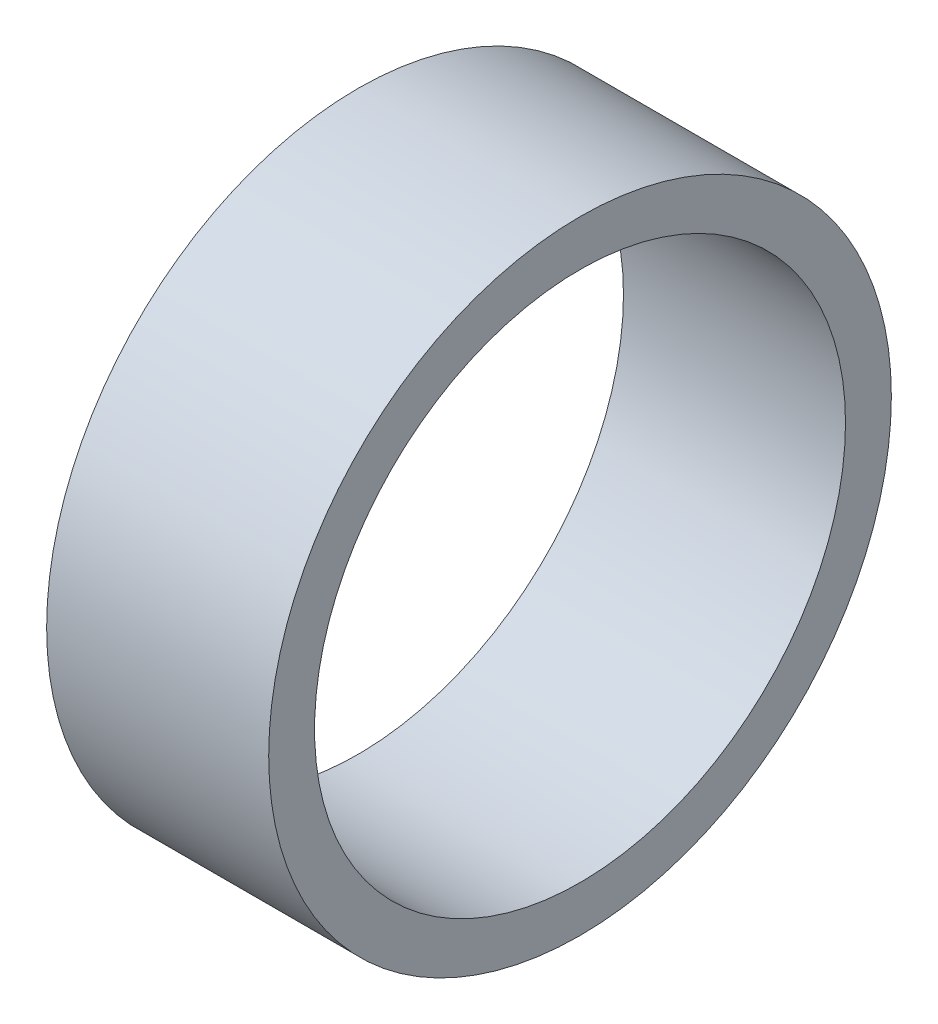
ISO-10303-21;
HEADER;
FILE_DESCRIPTION(('STEP AP214'),'2;1');
FILE_NAME('part.step','',(''),(''),'','','');
FILE_SCHEMA(('AUTOMOTIVE_DESIGN { 1 0 10303 214 1 1 1 1 }'));
ENDSEC;
DATA;
#1=APPLICATION_CONTEXT('core data for automotive mechanical design processes');
#2=APPLICATION_PROTOCOL_DEFINITION('international standard','automotive_design',2000,#1);
#3=PRODUCT_CONTEXT('',#1,'mechanical');
#4=PRODUCT('Part','Part','',(#3));
#5=PRODUCT_RELATED_PRODUCT_CATEGORY('part','',(#4));
#6=PRODUCT_DEFINITION_FORMATION('','',#4);
#7=PRODUCT_DEFINITION_CONTEXT('part definition',#1,'design');
#8=PRODUCT_DEFINITION('design','',#6,#7);
#9=PRODUCT_DEFINITION_SHAPE('','',#8);
#10=(LENGTH_UNIT() NAMED_UNIT(*) SI_UNIT(.MILLI.,.METRE.));
#11=(NAMED_UNIT(*) PLANE_ANGLE_UNIT() SI_UNIT($,.RADIAN.));
#12=(NAMED_UNIT(*) SI_UNIT($,.STERADIAN.) SOLID_ANGLE_UNIT());
#13=UNCERTAINTY_MEASURE_WITH_UNIT(LENGTH_MEASURE(1.E-05),#10,'distance_accuracy_value','');
#14=(GEOMETRIC_REPRESENTATION_CONTEXT(3) GLOBAL_UNCERTAINTY_ASSIGNED_CONTEXT((#13)) GLOBAL_UNIT_ASSIGNED_CONTEXT((#10,
#11,#12)) REPRESENTATION_CONTEXT('',''));
#15=CARTESIAN_POINT('',(0.,0.,0.));
#16=DIRECTION('',(0.,0.,1.));
#17=DIRECTION('',(1.,0.,0.));
#18=AXIS2_PLACEMENT_3D('',#15,#16,#17);
#19=CARTESIAN_POINT('',(23.,0.,0.));
#20=DIRECTION('',(1.,0.,0.));
#21=DIRECTION('',(0.,0.,-1.));
#22=AXIS2_PLACEMENT_3D('',#19,#20,#21);
#23=PLANE('',#22);
#24=CARTESIAN_POINT('',(23.,0.,0.));
#25=DIRECTION('',(1.,0.,0.));
#26=DIRECTION('',(0.,0.,-1.));
#27=AXIS2_PLACEMENT_3D('',#24,#25,#26);
#28=CIRCLE('',#27,32.25);
#29=CARTESIAN_POINT('',(23.,0.,-32.25));
#30=VERTEX_POINT('',#29);
#31=EDGE_CURVE('E11',#30,#30,#28,.T.);
#32=ORIENTED_EDGE('',*,*,#31,.T.);
#33=EDGE_LOOP('',(#32));
#34=FACE_BOUND('',#33,.T.);
#35=CARTESIAN_POINT('',(23.,0.,0.));
#36=DIRECTION('',(1.,0.,0.));
#37=DIRECTION('',(0.,0.,-1.));
#38=AXIS2_PLACEMENT_3D('',#35,#36,#37);
#39=CIRCLE('',#38,27.5);
#40=CARTESIAN_POINT('',(23.,0.,-27.5));
#41=VERTEX_POINT('',#40);
#42=EDGE_CURVE('E56',#41,#41,#39,.T.);
#43=ORIENTED_EDGE('',*,*,#42,.F.);
#44=EDGE_LOOP('',(#43));
#45=FACE_BOUND('',#44,.T.);
#46=ADVANCED_FACE('F43',(#34,#45),#23,.T.);
#47=CARTESIAN_POINT('',(0.,0.,0.));
#48=DIRECTION('',(1.,0.,0.));
#49=DIRECTION('',(0.,0.,-1.));
#50=AXIS2_PLACEMENT_3D('',#47,#48,#49);
#51=PLANE('',#50);
#52=CARTESIAN_POINT('',(0.,0.,0.));
#53=DIRECTION('',(1.,0.,0.));
#54=DIRECTION('',(0.,0.,-1.));
#55=AXIS2_PLACEMENT_3D('',#52,#53,#54);
#56=CIRCLE('',#55,32.25);
#57=CARTESIAN_POINT('',(0.,0.,-32.25));
#58=VERTEX_POINT('',#57);
#59=EDGE_CURVE('E47',#58,#58,#56,.T.);
#60=ORIENTED_EDGE('',*,*,#59,.F.);
#61=EDGE_LOOP('',(#60));
#62=FACE_BOUND('',#61,.T.);
#63=CARTESIAN_POINT('',(0.,0.,0.));
#64=DIRECTION('',(1.,0.,0.));
#65=DIRECTION('',(0.,0.,-1.));
#66=AXIS2_PLACEMENT_3D('',#63,#64,#65);
#67=CIRCLE('',#66,27.5);
#68=CARTESIAN_POINT('',(0.,0.,-27.5));
#69=VERTEX_POINT('',#68);
#70=EDGE_CURVE('E58',#69,#69,#67,.T.);
#71=ORIENTED_EDGE('',*,*,#70,.T.);
#72=EDGE_LOOP('',(#71));
#73=FACE_BOUND('',#72,.T.);
#74=ADVANCED_FACE('F70',(#62,#73),#51,.F.);
#75=CARTESIAN_POINT('',(23.,0.,0.));
#76=DIRECTION('',(-1.,0.,0.));
#77=DIRECTION('',(0.,0.,1.));
#78=AXIS2_PLACEMENT_3D('',#75,#76,#77);
#79=CYLINDRICAL_SURFACE('',#78,32.25);
#80=ORIENTED_EDGE('',*,*,#31,.F.);
#81=EDGE_LOOP('',(#80));
#82=FACE_BOUND('',#81,.T.);
#83=ORIENTED_EDGE('',*,*,#59,.T.);
#84=EDGE_LOOP('',(#83));
#85=FACE_BOUND('',#84,.T.);
#86=ADVANCED_FACE('F45',(#82,#85),#79,.T.);
#87=CARTESIAN_POINT('',(23.,0.,0.));
#88=DIRECTION('',(-1.,0.,0.));
#89=DIRECTION('',(0.,0.,1.));
#90=AXIS2_PLACEMENT_3D('',#87,#88,#89);
#91=CYLINDRICAL_SURFACE('',#90,27.5);
#92=ORIENTED_EDGE('',*,*,#42,.T.);
#93=EDGE_LOOP('',(#92));
#94=FACE_BOUND('',#93,.T.);
#95=ORIENTED_EDGE('',*,*,#70,.F.);
#96=EDGE_LOOP('',(#95));
#97=FACE_BOUND('',#96,.T.);
#98=ADVANCED_FACE('F66',(#94,#97),#91,.F.);
#99=CLOSED_SHELL('',(#46,#74,#86,#98));
#100=MANIFOLD_SOLID_BREP('B2',#99);
#101=ADVANCED_BREP_SHAPE_REPRESENTATION('',(#18,#100),#14);
#102=SHAPE_DEFINITION_REPRESENTATION(#9,#101);
ENDSEC;
END-ISO-10303-21;
